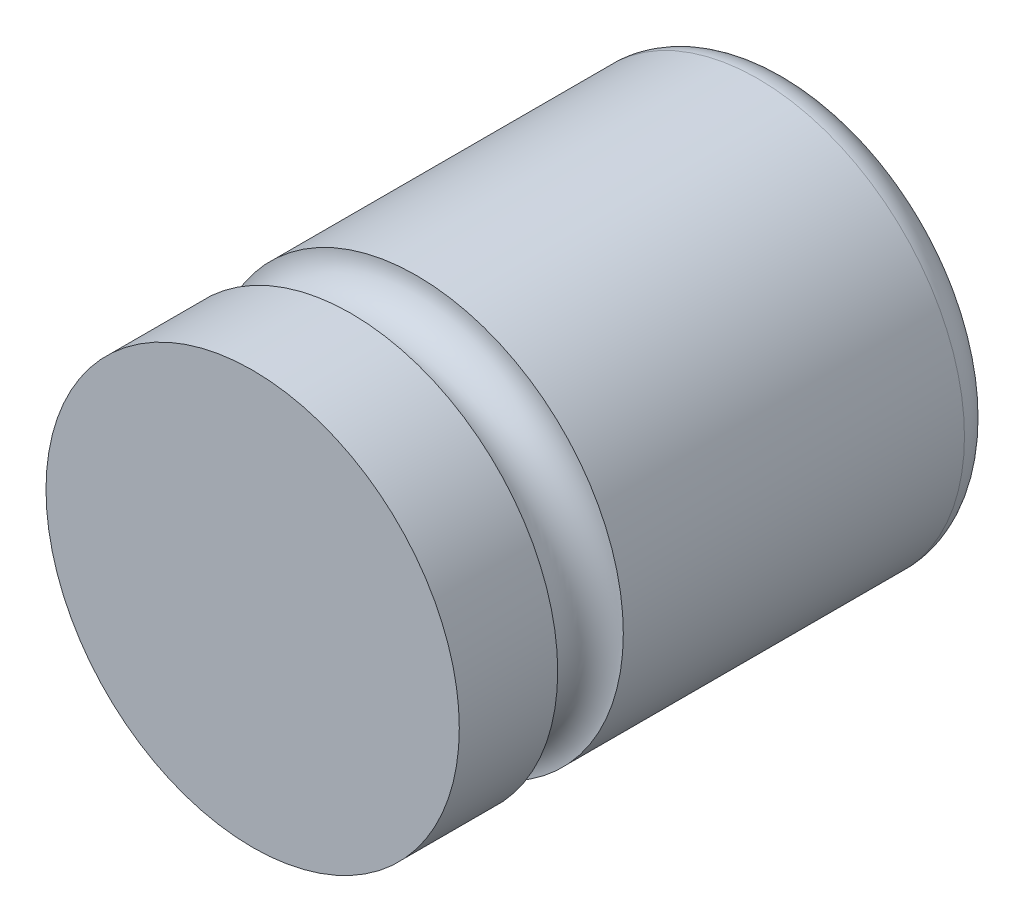
ISO-10303-21;
HEADER;
FILE_DESCRIPTION(('STEP AP214'),'2;1');
FILE_NAME('part.step','',(''),(''),'','','');
FILE_SCHEMA(('AUTOMOTIVE_DESIGN { 1 0 10303 214 1 1 1 1 }'));
ENDSEC;
DATA;
#1=APPLICATION_CONTEXT('core data for automotive mechanical design processes');
#2=APPLICATION_PROTOCOL_DEFINITION('international standard','automotive_design',2000,#1);
#3=PRODUCT_CONTEXT('',#1,'mechanical');
#4=PRODUCT('Part','Part','',(#3));
#5=PRODUCT_RELATED_PRODUCT_CATEGORY('part','',(#4));
#6=PRODUCT_DEFINITION_FORMATION('','',#4);
#7=PRODUCT_DEFINITION_CONTEXT('part definition',#1,'design');
#8=PRODUCT_DEFINITION('design','',#6,#7);
#9=PRODUCT_DEFINITION_SHAPE('','',#8);
#10=(LENGTH_UNIT() NAMED_UNIT(*) SI_UNIT(.MILLI.,.METRE.));
#11=(NAMED_UNIT(*) PLANE_ANGLE_UNIT() SI_UNIT($,.RADIAN.));
#12=(NAMED_UNIT(*) SI_UNIT($,.STERADIAN.) SOLID_ANGLE_UNIT());
#13=UNCERTAINTY_MEASURE_WITH_UNIT(LENGTH_MEASURE(1.E-05),#10,'distance_accuracy_value','');
#14=(GEOMETRIC_REPRESENTATION_CONTEXT(3) GLOBAL_UNCERTAINTY_ASSIGNED_CONTEXT((#13)) GLOBAL_UNIT_ASSIGNED_CONTEXT((#10,
#11,#12)) REPRESENTATION_CONTEXT('',''));
#15=CARTESIAN_POINT('',(0.,0.,0.));
#16=DIRECTION('',(0.,0.,1.));
#17=DIRECTION('',(1.,0.,0.));
#18=AXIS2_PLACEMENT_3D('',#15,#16,#17);
#19=CARTESIAN_POINT('',(0.,0.,-8.2));
#20=DIRECTION('',(0.,0.,-1.));
#21=DIRECTION('',(-1.,0.,0.));
#22=AXIS2_PLACEMENT_3D('',#19,#20,#21);
#23=PLANE('',#22);
#24=DIRECTION('',(0.,-1.,0.));
#25=VECTOR('',#24,1.);
#26=CARTESIAN_POINT('',(-1.5,2.18460522749534,-8.2));
#27=LINE('',#26,#25);
#28=CARTESIAN_POINT('',(-1.5,2.18460522749534,-8.2));
#29=VERTEX_POINT('',#28);
#30=CARTESIAN_POINT('',(-1.5,-2.18460522749534,-8.2));
#31=VERTEX_POINT('',#30);
#32=EDGE_CURVE('E55',#29,#31,#27,.T.);
#33=ORIENTED_EDGE('',*,*,#32,.F.);
#34=CARTESIAN_POINT('',(0.,0.,-8.2));
#35=DIRECTION('',(0.,0.,1.));
#36=DIRECTION('',(1.,0.,0.));
#37=AXIS2_PLACEMENT_3D('',#34,#35,#36);
#38=CIRCLE('',#37,2.65);
#39=EDGE_CURVE('E48',#31,#29,#38,.T.);
#40=ORIENTED_EDGE('',*,*,#39,.F.);
#41=EDGE_LOOP('',(#33,#40));
#42=FACE_BOUND('',#41,.T.);
#43=ADVANCED_FACE('F40',(#42),#23,.T.);
#44=CARTESIAN_POINT('',(0.,0.,-7.7));
#45=DIRECTION('',(0.,0.,1.));
#46=DIRECTION('',(1.,0.,0.));
#47=AXIS2_PLACEMENT_3D('',#44,#45,#46);
#48=TOROIDAL_SURFACE('',#47,2.65,0.5);
#49=EDGE_CURVE('E11',#29,#31,#38,.T.);
#50=ORIENTED_EDGE('',*,*,#49,.T.);
#51=ORIENTED_EDGE('',*,*,#39,.T.);
#52=EDGE_LOOP('',(#50,#51));
#53=FACE_BOUND('',#52,.T.);
#54=CARTESIAN_POINT('',(0.,0.,-7.69999999999999));
#55=DIRECTION('',(0.,0.,1.));
#56=DIRECTION('',(1.,0.,0.));
#57=AXIS2_PLACEMENT_3D('',#54,#55,#56);
#58=CIRCLE('',#57,3.15);
#59=CARTESIAN_POINT('',(3.15,0.,-7.69999999999999));
#60=VERTEX_POINT('',#59);
#61=EDGE_CURVE('E85',#60,#60,#58,.T.);
#62=ORIENTED_EDGE('',*,*,#61,.F.);
#63=EDGE_LOOP('',(#62));
#64=FACE_BOUND('',#63,.T.);
#65=ADVANCED_FACE('F82',(#53,#64),#48,.T.);
#66=CARTESIAN_POINT('',(0.,0.,0.));
#67=DIRECTION('',(0.,0.,1.));
#68=DIRECTION('',(1.,0.,0.));
#69=AXIS2_PLACEMENT_3D('',#66,#67,#68);
#70=CYLINDRICAL_SURFACE('',#69,3.15);
#71=ORIENTED_EDGE('',*,*,#61,.T.);
#72=EDGE_LOOP('',(#71));
#73=FACE_BOUND('',#72,.T.);
#74=CARTESIAN_POINT('',(0.,0.,-2.5));
#75=DIRECTION('',(0.,0.,1.));
#76=DIRECTION('',(1.,0.,0.));
#77=AXIS2_PLACEMENT_3D('',#74,#75,#76);
#78=CIRCLE('',#77,3.15);
#79=CARTESIAN_POINT('',(3.15,0.,-2.5));
#80=VERTEX_POINT('',#79);
#81=EDGE_CURVE('E88',#80,#80,#78,.T.);
#82=ORIENTED_EDGE('',*,*,#81,.F.);
#83=EDGE_LOOP('',(#82));
#84=FACE_BOUND('',#83,.T.);
#85=ADVANCED_FACE('F120',(#73,#84),#70,.T.);
#86=CARTESIAN_POINT('',(0.,0.,-2.));
#87=DIRECTION('',(0.,0.,1.));
#88=DIRECTION('',(1.,0.,0.));
#89=AXIS2_PLACEMENT_3D('',#86,#87,#88);
#90=TOROIDAL_SURFACE('',#89,3.15,0.5);
#91=ORIENTED_EDGE('',*,*,#81,.T.);
#92=EDGE_LOOP('',(#91));
#93=FACE_BOUND('',#92,.T.);
#94=CARTESIAN_POINT('',(0.,0.,-1.5));
#95=DIRECTION('',(0.,0.,1.));
#96=DIRECTION('',(1.,0.,0.));
#97=AXIS2_PLACEMENT_3D('',#94,#95,#96);
#98=CIRCLE('',#97,3.15);
#99=CARTESIAN_POINT('',(3.15,0.,-1.5));
#100=VERTEX_POINT('',#99);
#101=EDGE_CURVE('E93',#100,#100,#98,.T.);
#102=ORIENTED_EDGE('',*,*,#101,.F.);
#103=EDGE_LOOP('',(#102));
#104=FACE_BOUND('',#103,.T.);
#105=ADVANCED_FACE('F124',(#93,#104),#90,.F.);
#106=CARTESIAN_POINT('',(0.,0.,0.));
#107=DIRECTION('',(0.,0.,1.));
#108=DIRECTION('',(1.,0.,0.));
#109=AXIS2_PLACEMENT_3D('',#106,#107,#108);
#110=CYLINDRICAL_SURFACE('',#109,3.15);
#111=ORIENTED_EDGE('',*,*,#101,.T.);
#112=EDGE_LOOP('',(#111));
#113=FACE_BOUND('',#112,.T.);
#114=CARTESIAN_POINT('',(0.,0.,0.));
#115=DIRECTION('',(0.,0.,1.));
#116=DIRECTION('',(1.,0.,0.));
#117=AXIS2_PLACEMENT_3D('',#114,#115,#116);
#118=CIRCLE('',#117,3.15);
#119=CARTESIAN_POINT('',(3.15,0.,0.));
#120=VERTEX_POINT('',#119);
#121=EDGE_CURVE('E99',#120,#120,#118,.T.);
#122=ORIENTED_EDGE('',*,*,#121,.F.);
#123=EDGE_LOOP('',(#122));
#124=FACE_BOUND('',#123,.T.);
#125=ADVANCED_FACE('F129',(#113,#124),#110,.T.);
#126=CARTESIAN_POINT('',(0.,0.,0.));
#127=DIRECTION('',(0.,0.,1.));
#128=DIRECTION('',(1.,0.,0.));
#129=AXIS2_PLACEMENT_3D('',#126,#127,#128);
#130=PLANE('',#129);
#131=ORIENTED_EDGE('',*,*,#121,.T.);
#132=EDGE_LOOP('',(#131));
#133=FACE_BOUND('',#132,.T.);
#134=ADVANCED_FACE('F133',(#133),#130,.T.);
#135=CARTESIAN_POINT('',(0.,0.,-8.19));
#136=DIRECTION('',(0.,0.,-1.));
#137=DIRECTION('',(-1.,0.,0.));
#138=AXIS2_PLACEMENT_3D('',#135,#136,#137);
#139=CYLINDRICAL_SURFACE('',#138,2.65);
#140=ORIENTED_EDGE('',*,*,#49,.F.);
#141=DIRECTION('',(0.,0.,-1.));
#142=VECTOR('',#141,1.);
#143=CARTESIAN_POINT('',(-1.5,2.18460522749534,-8.19));
#144=LINE('',#143,#142);
#145=CARTESIAN_POINT('',(-1.5,2.18460522749534,-8.19));
#146=VERTEX_POINT('',#145);
#147=EDGE_CURVE('E65',#146,#29,#144,.T.);
#148=ORIENTED_EDGE('',*,*,#147,.F.);
#149=CARTESIAN_POINT('',(0.,0.,-8.19));
#150=DIRECTION('',(0.,0.,-1.));
#151=DIRECTION('',(-1.,0.,0.));
#152=AXIS2_PLACEMENT_3D('',#149,#150,#151);
#153=CIRCLE('',#152,2.65);
#154=CARTESIAN_POINT('',(-1.5,-2.18460522749534,-8.19));
#155=VERTEX_POINT('',#154);
#156=EDGE_CURVE('E80',#155,#146,#153,.T.);
#157=ORIENTED_EDGE('',*,*,#156,.F.);
#158=DIRECTION('',(0.,0.,-1.));
#159=VECTOR('',#158,1.);
#160=CARTESIAN_POINT('',(-1.5,-2.18460522749534,-8.19));
#161=LINE('',#160,#159);
#162=EDGE_CURVE('E60',#155,#31,#161,.T.);
#163=ORIENTED_EDGE('',*,*,#162,.T.);
#164=EDGE_LOOP('',(#140,#148,#157,#163));
#165=FACE_BOUND('',#164,.T.);
#166=ADVANCED_FACE('F74',(#165),#139,.F.);
#167=CARTESIAN_POINT('',(-1.5,2.18460522749534,-8.19));
#168=DIRECTION('',(1.,0.,0.));
#169=DIRECTION('',(0.,0.,-1.));
#170=AXIS2_PLACEMENT_3D('',#167,#168,#169);
#171=PLANE('',#170);
#172=ORIENTED_EDGE('',*,*,#32,.T.);
#173=ORIENTED_EDGE('',*,*,#162,.F.);
#174=DIRECTION('',(0.,-1.,0.));
#175=VECTOR('',#174,1.);
#176=CARTESIAN_POINT('',(-1.5,2.18460522749534,-8.19));
#177=LINE('',#176,#175);
#178=EDGE_CURVE('E69',#146,#155,#177,.T.);
#179=ORIENTED_EDGE('',*,*,#178,.F.);
#180=ORIENTED_EDGE('',*,*,#147,.T.);
#181=EDGE_LOOP('',(#172,#173,#179,#180));
#182=FACE_BOUND('',#181,.T.);
#183=ADVANCED_FACE('F67',(#182),#171,.F.);
#184=CARTESIAN_POINT('',(0.,0.,-8.19));
#185=DIRECTION('',(0.,0.,-1.));
#186=DIRECTION('',(-1.,0.,0.));
#187=AXIS2_PLACEMENT_3D('',#184,#185,#186);
#188=PLANE('',#187);
#189=ORIENTED_EDGE('',*,*,#156,.T.);
#190=ORIENTED_EDGE('',*,*,#178,.T.);
#191=EDGE_LOOP('',(#189,#190));
#192=FACE_BOUND('',#191,.T.);
#193=ADVANCED_FACE('F109',(#192),#188,.T.);
#194=CLOSED_SHELL('',(#43,#65,#85,#105,#125,#134,#166,#183,#193));
#195=MANIFOLD_SOLID_BREP('B2',#194);
#196=ADVANCED_BREP_SHAPE_REPRESENTATION('',(#18,#195),#14);
#197=SHAPE_DEFINITION_REPRESENTATION(#9,#196);
ENDSEC;
END-ISO-10303-21;
